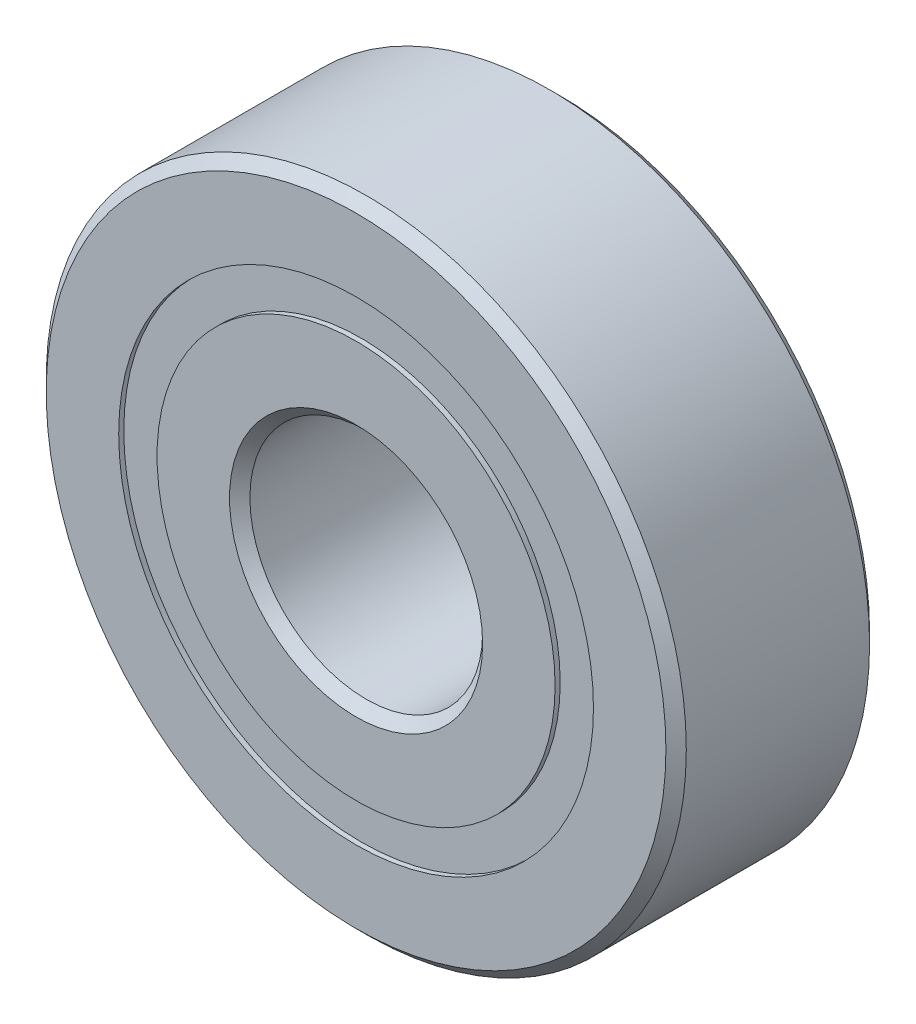
ISO-10303-21;
HEADER;
FILE_DESCRIPTION(('STEP AP214'),'2;1');
FILE_NAME('part.step','',(''),(''),'','','');
FILE_SCHEMA(('AUTOMOTIVE_DESIGN { 1 0 10303 214 1 1 1 1 }'));
ENDSEC;
DATA;
#1=APPLICATION_CONTEXT('core data for automotive mechanical design processes');
#2=APPLICATION_PROTOCOL_DEFINITION('international standard','automotive_design',2000,#1);
#3=PRODUCT_CONTEXT('',#1,'mechanical');
#4=PRODUCT('Part','Part','',(#3));
#5=PRODUCT_RELATED_PRODUCT_CATEGORY('part','',(#4));
#6=PRODUCT_DEFINITION_FORMATION('','',#4);
#7=PRODUCT_DEFINITION_CONTEXT('part definition',#1,'design');
#8=PRODUCT_DEFINITION('design','',#6,#7);
#9=PRODUCT_DEFINITION_SHAPE('','',#8);
#10=(LENGTH_UNIT() NAMED_UNIT(*) SI_UNIT(.MILLI.,.METRE.));
#11=(NAMED_UNIT(*) PLANE_ANGLE_UNIT() SI_UNIT($,.RADIAN.));
#12=(NAMED_UNIT(*) SI_UNIT($,.STERADIAN.) SOLID_ANGLE_UNIT());
#13=UNCERTAINTY_MEASURE_WITH_UNIT(LENGTH_MEASURE(1.E-05),#10,'distance_accuracy_value','');
#14=(GEOMETRIC_REPRESENTATION_CONTEXT(3) GLOBAL_UNCERTAINTY_ASSIGNED_CONTEXT((#13)) GLOBAL_UNIT_ASSIGNED_CONTEXT((#10,
#11,#12)) REPRESENTATION_CONTEXT('',''));
#15=CARTESIAN_POINT('',(0.,0.,0.));
#16=DIRECTION('',(0.,0.,1.));
#17=DIRECTION('',(1.,0.,0.));
#18=AXIS2_PLACEMENT_3D('',#15,#16,#17);
#19=CARTESIAN_POINT('',(0.,8.15934065934066,-3.325));
#20=DIRECTION('',(0.,0.,1.));
#21=DIRECTION('',(1.,0.,0.));
#22=AXIS2_PLACEMENT_3D('',#19,#20,#21);
#23=PLANE('',#22);
#24=CARTESIAN_POINT('',(0.,0.,-3.325));
#25=DIRECTION('',(0.,0.,1.));
#26=DIRECTION('',(1.,0.,0.));
#27=AXIS2_PLACEMENT_3D('',#24,#25,#26);
#28=CIRCLE('',#27,8.15934065934066);
#29=CARTESIAN_POINT('',(8.15934065934066,0.,-3.325));
#30=VERTEX_POINT('',#29);
#31=EDGE_CURVE('E59',#30,#30,#28,.T.);
#32=ORIENTED_EDGE('',*,*,#31,.F.);
#33=EDGE_LOOP('',(#32));
#34=FACE_BOUND('',#33,.T.);
#35=CARTESIAN_POINT('',(0.,0.,-3.325));
#36=DIRECTION('',(0.,0.,1.));
#37=DIRECTION('',(1.,0.,0.));
#38=AXIS2_PLACEMENT_3D('',#35,#36,#37);
#39=CIRCLE('',#38,6.84065934065934);
#40=CARTESIAN_POINT('',(6.84065934065934,0.,-3.325));
#41=VERTEX_POINT('',#40);
#42=EDGE_CURVE('E11',#41,#41,#39,.T.);
#43=ORIENTED_EDGE('',*,*,#42,.T.);
#44=EDGE_LOOP('',(#43));
#45=FACE_BOUND('',#44,.T.);
#46=ADVANCED_FACE('F45',(#34,#45),#23,.F.);
#47=CARTESIAN_POINT('',(0.,0.,3.5));
#48=DIRECTION('',(0.,0.,1.));
#49=DIRECTION('',(1.,0.,0.));
#50=AXIS2_PLACEMENT_3D('',#47,#48,#49);
#51=CYLINDRICAL_SURFACE('',#50,6.84065934065934);
#52=ORIENTED_EDGE('',*,*,#42,.F.);
#53=EDGE_LOOP('',(#52));
#54=FACE_BOUND('',#53,.T.);
#55=CARTESIAN_POINT('',(0.,0.,-1.68952158656808));
#56=DIRECTION('',(0.,0.,1.));
#57=DIRECTION('',(1.,0.,0.));
#58=AXIS2_PLACEMENT_3D('',#55,#56,#57);
#59=CIRCLE('',#58,6.84065934065934);
#60=CARTESIAN_POINT('',(6.84065934065934,0.,-1.68952158656808));
#61=VERTEX_POINT('',#60);
#62=EDGE_CURVE('E51',#61,#61,#59,.T.);
#63=ORIENTED_EDGE('',*,*,#62,.T.);
#64=EDGE_LOOP('',(#63));
#65=FACE_BOUND('',#64,.T.);
#66=ADVANCED_FACE('F68',(#54,#65),#51,.F.);
#67=CARTESIAN_POINT('',(0.,8.15934065934066,-1.68952158656808));
#68=DIRECTION('',(0.,0.,-1.));
#69=DIRECTION('',(-1.,0.,0.));
#70=AXIS2_PLACEMENT_3D('',#67,#68,#69);
#71=PLANE('',#70);
#72=ORIENTED_EDGE('',*,*,#62,.F.);
#73=EDGE_LOOP('',(#72));
#74=FACE_BOUND('',#73,.T.);
#75=CARTESIAN_POINT('',(0.,0.,-1.68952158656808));
#76=DIRECTION('',(0.,0.,1.));
#77=DIRECTION('',(1.,0.,0.));
#78=AXIS2_PLACEMENT_3D('',#75,#76,#77);
#79=CIRCLE('',#78,8.15934065934066);
#80=CARTESIAN_POINT('',(8.15934065934066,0.,-1.68952158656808));
#81=VERTEX_POINT('',#80);
#82=EDGE_CURVE('E55',#81,#81,#79,.T.);
#83=ORIENTED_EDGE('',*,*,#82,.T.);
#84=EDGE_LOOP('',(#83));
#85=FACE_BOUND('',#84,.T.);
#86=ADVANCED_FACE('F72',(#74,#85),#71,.F.);
#87=CARTESIAN_POINT('',(0.,0.,3.5));
#88=DIRECTION('',(0.,0.,1.));
#89=DIRECTION('',(1.,0.,0.));
#90=AXIS2_PLACEMENT_3D('',#87,#88,#89);
#91=CYLINDRICAL_SURFACE('',#90,8.15934065934066);
#92=ORIENTED_EDGE('',*,*,#82,.F.);
#93=EDGE_LOOP('',(#92));
#94=FACE_BOUND('',#93,.T.);
#95=ORIENTED_EDGE('',*,*,#31,.T.);
#96=EDGE_LOOP('',(#95));
#97=FACE_BOUND('',#96,.T.);
#98=ADVANCED_FACE('F65',(#94,#97),#91,.T.);
#99=CLOSED_SHELL('',(#46,#66,#86,#98));
#100=MANIFOLD_SOLID_BREP('B2',#99);
#101=CARTESIAN_POINT('',(0.,8.15934065934066,3.325));
#102=DIRECTION('',(0.,0.,-1.));
#103=DIRECTION('',(-1.,0.,0.));
#104=AXIS2_PLACEMENT_3D('',#101,#102,#103);
#105=PLANE('',#104);
#106=CARTESIAN_POINT('',(0.,0.,3.325));
#107=DIRECTION('',(0.,0.,1.));
#108=DIRECTION('',(1.,0.,0.));
#109=AXIS2_PLACEMENT_3D('',#106,#107,#108);
#110=CIRCLE('',#109,6.84065934065934);
#111=CARTESIAN_POINT('',(6.84065934065934,0.,3.325));
#112=VERTEX_POINT('',#111);
#113=EDGE_CURVE('E44',#112,#112,#110,.T.);
#114=ORIENTED_EDGE('',*,*,#113,.F.);
#115=EDGE_LOOP('',(#114));
#116=FACE_BOUND('',#115,.T.);
#117=CARTESIAN_POINT('',(0.,0.,3.325));
#118=DIRECTION('',(0.,0.,1.));
#119=DIRECTION('',(1.,0.,0.));
#120=AXIS2_PLACEMENT_3D('',#117,#118,#119);
#121=CIRCLE('',#120,8.15934065934066);
#122=CARTESIAN_POINT('',(8.15934065934066,0.,3.325));
#123=VERTEX_POINT('',#122);
#124=EDGE_CURVE('E126',#123,#123,#121,.T.);
#125=ORIENTED_EDGE('',*,*,#124,.T.);
#126=EDGE_LOOP('',(#125));
#127=FACE_BOUND('',#126,.T.);
#128=ADVANCED_FACE('F112',(#116,#127),#105,.F.);
#129=CARTESIAN_POINT('',(0.,0.,3.5));
#130=DIRECTION('',(0.,0.,1.));
#131=DIRECTION('',(1.,0.,0.));
#132=AXIS2_PLACEMENT_3D('',#129,#130,#131);
#133=CYLINDRICAL_SURFACE('',#132,6.84065934065934);
#134=CARTESIAN_POINT('',(0.,0.,1.68952158656808));
#135=DIRECTION('',(0.,0.,1.));
#136=DIRECTION('',(1.,0.,0.));
#137=AXIS2_PLACEMENT_3D('',#134,#135,#136);
#138=CIRCLE('',#137,6.84065934065934);
#139=CARTESIAN_POINT('',(6.84065934065934,0.,1.68952158656808));
#140=VERTEX_POINT('',#139);
#141=EDGE_CURVE('E118',#140,#140,#138,.T.);
#142=ORIENTED_EDGE('',*,*,#141,.F.);
#143=EDGE_LOOP('',(#142));
#144=FACE_BOUND('',#143,.T.);
#145=ORIENTED_EDGE('',*,*,#113,.T.);
#146=EDGE_LOOP('',(#145));
#147=FACE_BOUND('',#146,.T.);
#148=ADVANCED_FACE('F141',(#144,#147),#133,.F.);
#149=CARTESIAN_POINT('',(0.,8.15934065934066,1.68952158656808));
#150=DIRECTION('',(0.,0.,1.));
#151=DIRECTION('',(1.,0.,0.));
#152=AXIS2_PLACEMENT_3D('',#149,#150,#151);
#153=PLANE('',#152);
#154=CARTESIAN_POINT('',(0.,0.,1.68952158656808));
#155=DIRECTION('',(0.,0.,1.));
#156=DIRECTION('',(1.,0.,0.));
#157=AXIS2_PLACEMENT_3D('',#154,#155,#156);
#158=CIRCLE('',#157,8.15934065934066);
#159=CARTESIAN_POINT('',(8.15934065934066,0.,1.68952158656808));
#160=VERTEX_POINT('',#159);
#161=EDGE_CURVE('E122',#160,#160,#158,.T.);
#162=ORIENTED_EDGE('',*,*,#161,.F.);
#163=EDGE_LOOP('',(#162));
#164=FACE_BOUND('',#163,.T.);
#165=ORIENTED_EDGE('',*,*,#141,.T.);
#166=EDGE_LOOP('',(#165));
#167=FACE_BOUND('',#166,.T.);
#168=ADVANCED_FACE('F136',(#164,#167),#153,.F.);
#169=CARTESIAN_POINT('',(0.,0.,3.5));
#170=DIRECTION('',(0.,0.,1.));
#171=DIRECTION('',(1.,0.,0.));
#172=AXIS2_PLACEMENT_3D('',#169,#170,#171);
#173=CYLINDRICAL_SURFACE('',#172,8.15934065934066);
#174=ORIENTED_EDGE('',*,*,#124,.F.);
#175=EDGE_LOOP('',(#174));
#176=FACE_BOUND('',#175,.T.);
#177=ORIENTED_EDGE('',*,*,#161,.T.);
#178=EDGE_LOOP('',(#177));
#179=FACE_BOUND('',#178,.T.);
#180=ADVANCED_FACE('F133',(#176,#179),#173,.T.);
#181=CLOSED_SHELL('',(#128,#148,#168,#180));
#182=MANIFOLD_SOLID_BREP('B6',#181);
#183=CARTESIAN_POINT('',(-3.74999999999992,6.49519052838334,0.));
#184=DIRECTION('',(0.,0.,1.));
#185=DIRECTION('',(-0.499999999999989,0.866025403784445,0.));
#186=AXIS2_PLACEMENT_3D('',#183,#184,#185);
#187=SPHERICAL_SURFACE('',#186,1.68952158656808);
#188=CARTESIAN_POINT('',(-3.74999999999992,6.49519052838334,1.68952158656808));
#189=VERTEX_POINT('',#188);
#190=VERTEX_LOOP('',#189);
#191=FACE_BOUND('',#190,.T.);
#192=ADVANCED_FACE('F179',(#191),#187,.T.);
#193=CLOSED_SHELL('',(#192));
#194=MANIFOLD_SOLID_BREP('B39',#193);
#195=CARTESIAN_POINT('',(-6.49519052838325,3.75000000000008,0.));
#196=DIRECTION('',(0.,0.,1.));
#197=DIRECTION('',(-0.866025403784433,0.50000000000001,0.));
#198=AXIS2_PLACEMENT_3D('',#195,#196,#197);
#199=SPHERICAL_SURFACE('',#198,1.68952158656808);
#200=CARTESIAN_POINT('',(-6.49519052838325,3.75000000000008,1.68952158656808));
#201=VERTEX_POINT('',#200);
#202=VERTEX_LOOP('',#201);
#203=FACE_BOUND('',#202,.T.);
#204=ADVANCED_FACE('F199',(#203),#199,.T.);
#205=CLOSED_SHELL('',(#204));
#206=MANIFOLD_SOLID_BREP('B108',#205);
#207=CARTESIAN_POINT('',(-7.5,0.,0.));
#208=DIRECTION('',(0.,0.,1.));
#209=DIRECTION('',(-1.,0.,0.));
#210=AXIS2_PLACEMENT_3D('',#207,#208,#209);
#211=SPHERICAL_SURFACE('',#210,1.68952158656808);
#212=CARTESIAN_POINT('',(-7.5,0.,1.68952158656808));
#213=VERTEX_POINT('',#212);
#214=VERTEX_LOOP('',#213);
#215=FACE_BOUND('',#214,.T.);
#216=ADVANCED_FACE('F219',(#215),#211,.T.);
#217=CLOSED_SHELL('',(#216));
#218=MANIFOLD_SOLID_BREP('B175',#217);
#219=CARTESIAN_POINT('',(-6.49519052838332,-3.74999999999994,0.));
#220=DIRECTION('',(0.,0.,1.));
#221=DIRECTION('',(-0.866025403784443,-0.499999999999992,0.));
#222=AXIS2_PLACEMENT_3D('',#219,#220,#221);
#223=SPHERICAL_SURFACE('',#222,1.68952158656808);
#224=CARTESIAN_POINT('',(-6.49519052838332,-3.74999999999994,1.68952158656808));
#225=VERTEX_POINT('',#224);
#226=VERTEX_LOOP('',#225);
#227=FACE_BOUND('',#226,.T.);
#228=ADVANCED_FACE('F239',(#227),#223,.T.);
#229=CLOSED_SHELL('',(#228));
#230=MANIFOLD_SOLID_BREP('B195',#229);
#231=CARTESIAN_POINT('',(-3.75000000000005,-6.49519052838326,0.));
#232=DIRECTION('',(0.,0.,1.));
#233=DIRECTION('',(-0.500000000000007,-0.866025403784435,0.));
#234=AXIS2_PLACEMENT_3D('',#231,#232,#233);
#235=SPHERICAL_SURFACE('',#234,1.68952158656808);
#236=CARTESIAN_POINT('',(-3.75000000000005,-6.49519052838326,1.68952158656808));
#237=VERTEX_POINT('',#236);
#238=VERTEX_LOOP('',#237);
#239=FACE_BOUND('',#238,.T.);
#240=ADVANCED_FACE('F259',(#239),#235,.T.);
#241=CLOSED_SHELL('',(#240));
#242=MANIFOLD_SOLID_BREP('B215',#241);
#243=CARTESIAN_POINT('',(0.,-7.5,0.));
#244=DIRECTION('',(0.,0.,1.));
#245=DIRECTION('',(0.,-1.,0.));
#246=AXIS2_PLACEMENT_3D('',#243,#244,#245);
#247=SPHERICAL_SURFACE('',#246,1.68952158656808);
#248=CARTESIAN_POINT('',(0.,-7.5,1.68952158656808));
#249=VERTEX_POINT('',#248);
#250=VERTEX_LOOP('',#249);
#251=FACE_BOUND('',#250,.T.);
#252=ADVANCED_FACE('F279',(#251),#247,.T.);
#253=CLOSED_SHELL('',(#252));
#254=MANIFOLD_SOLID_BREP('B235',#253);
#255=CARTESIAN_POINT('',(3.74999999999996,-6.49519052838331,0.));
#256=DIRECTION('',(0.,0.,1.));
#257=DIRECTION('',(0.499999999999995,-0.866025403784442,0.));
#258=AXIS2_PLACEMENT_3D('',#255,#256,#257);
#259=SPHERICAL_SURFACE('',#258,1.68952158656808);
#260=CARTESIAN_POINT('',(3.74999999999996,-6.49519052838331,1.68952158656808));
#261=VERTEX_POINT('',#260);
#262=VERTEX_LOOP('',#261);
#263=FACE_BOUND('',#262,.T.);
#264=ADVANCED_FACE('F299',(#263),#259,.T.);
#265=CLOSED_SHELL('',(#264));
#266=MANIFOLD_SOLID_BREP('B255',#265);
#267=CARTESIAN_POINT('',(6.49519052838327,-3.75000000000003,0.));
#268=DIRECTION('',(0.,0.,1.));
#269=DIRECTION('',(0.866025403784436,-0.500000000000004,0.));
#270=AXIS2_PLACEMENT_3D('',#267,#268,#269);
#271=SPHERICAL_SURFACE('',#270,1.68952158656808);
#272=CARTESIAN_POINT('',(6.49519052838327,-3.75000000000003,1.68952158656808));
#273=VERTEX_POINT('',#272);
#274=VERTEX_LOOP('',#273);
#275=FACE_BOUND('',#274,.T.);
#276=ADVANCED_FACE('F319',(#275),#271,.T.);
#277=CLOSED_SHELL('',(#276));
#278=MANIFOLD_SOLID_BREP('B275',#277);
#279=CARTESIAN_POINT('',(7.5,0.,0.));
#280=DIRECTION('',(0.,0.,1.));
#281=DIRECTION('',(1.,0.,0.));
#282=AXIS2_PLACEMENT_3D('',#279,#280,#281);
#283=SPHERICAL_SURFACE('',#282,1.68952158656808);
#284=CARTESIAN_POINT('',(7.5,0.,1.68952158656808));
#285=VERTEX_POINT('',#284);
#286=VERTEX_LOOP('',#285);
#287=FACE_BOUND('',#286,.T.);
#288=ADVANCED_FACE('F339',(#287),#283,.T.);
#289=CLOSED_SHELL('',(#288));
#290=MANIFOLD_SOLID_BREP('B295',#289);
#291=CARTESIAN_POINT('',(6.4951905283833,3.74999999999998,0.));
#292=DIRECTION('',(0.,0.,1.));
#293=DIRECTION('',(0.86602540378444,0.499999999999998,0.));
#294=AXIS2_PLACEMENT_3D('',#291,#292,#293);
#295=SPHERICAL_SURFACE('',#294,1.68952158656808);
#296=CARTESIAN_POINT('',(6.4951905283833,3.74999999999998,1.68952158656808));
#297=VERTEX_POINT('',#296);
#298=VERTEX_LOOP('',#297);
#299=FACE_BOUND('',#298,.T.);
#300=ADVANCED_FACE('F359',(#299),#295,.T.);
#301=CLOSED_SHELL('',(#300));
#302=MANIFOLD_SOLID_BREP('B315',#301);
#303=CARTESIAN_POINT('',(3.75000000000001,6.49519052838328,0.));
#304=DIRECTION('',(0.,0.,1.));
#305=DIRECTION('',(0.500000000000001,0.866025403784438,0.));
#306=AXIS2_PLACEMENT_3D('',#303,#304,#305);
#307=SPHERICAL_SURFACE('',#306,1.68952158656808);
#308=CARTESIAN_POINT('',(3.75000000000001,6.49519052838328,1.68952158656808));
#309=VERTEX_POINT('',#308);
#310=VERTEX_LOOP('',#309);
#311=FACE_BOUND('',#310,.T.);
#312=ADVANCED_FACE('F379',(#311),#307,.T.);
#313=CLOSED_SHELL('',(#312));
#314=MANIFOLD_SOLID_BREP('B335',#313);
#315=CARTESIAN_POINT('',(0.,7.5,0.));
#316=DIRECTION('',(0.,0.,1.));
#317=DIRECTION('',(0.,1.,0.));
#318=AXIS2_PLACEMENT_3D('',#315,#316,#317);
#319=SPHERICAL_SURFACE('',#318,1.68952158656808);
#320=CARTESIAN_POINT('',(0.,7.5,1.68952158656808));
#321=VERTEX_POINT('',#320);
#322=VERTEX_LOOP('',#321);
#323=FACE_BOUND('',#322,.T.);
#324=ADVANCED_FACE('F401',(#323),#319,.T.);
#325=CLOSED_SHELL('',(#324));
#326=MANIFOLD_SOLID_BREP('B355',#325);
#327=CARTESIAN_POINT('',(0.,6.84065934065934,3.5));
#328=DIRECTION('',(0.,0.,-1.));
#329=DIRECTION('',(-1.,0.,0.));
#330=AXIS2_PLACEMENT_3D('',#327,#328,#329);
#331=PLANE('',#330);
#332=CARTESIAN_POINT('',(0.,0.,3.5));
#333=DIRECTION('',(0.,0.,1.));
#334=DIRECTION('',(1.,0.,0.));
#335=AXIS2_PLACEMENT_3D('',#332,#333,#334);
#336=CIRCLE('',#335,4.35);
#337=CARTESIAN_POINT('',(4.35,0.,3.5));
#338=VERTEX_POINT('',#337);
#339=EDGE_CURVE('E448',#338,#338,#336,.T.);
#340=ORIENTED_EDGE('',*,*,#339,.F.);
#341=EDGE_LOOP('',(#340));
#342=FACE_BOUND('',#341,.T.);
#343=CARTESIAN_POINT('',(0.,0.,3.5));
#344=DIRECTION('',(0.,0.,1.));
#345=DIRECTION('',(1.,0.,0.));
#346=AXIS2_PLACEMENT_3D('',#343,#344,#345);
#347=CIRCLE('',#346,6.84065934065934);
#348=CARTESIAN_POINT('',(6.84065934065934,0.,3.5));
#349=VERTEX_POINT('',#348);
#350=EDGE_CURVE('E400',#349,#349,#347,.T.);
#351=ORIENTED_EDGE('',*,*,#350,.T.);
#352=EDGE_LOOP('',(#351));
#353=FACE_BOUND('',#352,.T.);
#354=ADVANCED_FACE('F420',(#342,#353),#331,.F.);
#355=CARTESIAN_POINT('',(0.,0.,3.5));
#356=DIRECTION('',(0.,0.,1.));
#357=DIRECTION('',(1.,0.,0.));
#358=AXIS2_PLACEMENT_3D('',#355,#356,#357);
#359=CYLINDRICAL_SURFACE('',#358,6.84065934065934);
#360=ORIENTED_EDGE('',*,*,#350,.F.);
#361=EDGE_LOOP('',(#360));
#362=FACE_BOUND('',#361,.T.);
#363=CARTESIAN_POINT('',(0.,0.,1.55555555555556));
#364=DIRECTION('',(0.,0.,1.));
#365=DIRECTION('',(1.,0.,0.));
#366=AXIS2_PLACEMENT_3D('',#363,#364,#365);
#367=CIRCLE('',#366,6.84065934065934);
#368=CARTESIAN_POINT('',(6.84065934065934,0.,1.55555555555556));
#369=VERTEX_POINT('',#368);
#370=EDGE_CURVE('E426',#369,#369,#367,.T.);
#371=ORIENTED_EDGE('',*,*,#370,.T.);
#372=EDGE_LOOP('',(#371));
#373=FACE_BOUND('',#372,.T.);
#374=ADVANCED_FACE('F455',(#362,#373),#359,.T.);
#375=CARTESIAN_POINT('',(0.,0.,0.));
#376=DIRECTION('',(0.,0.,1.));
#377=DIRECTION('',(1.,0.,0.));
#378=AXIS2_PLACEMENT_3D('',#375,#376,#377);
#379=TOROIDAL_SURFACE('',#378,7.49999999999999,1.68952158656808);
#380=ORIENTED_EDGE('',*,*,#370,.F.);
#381=EDGE_LOOP('',(#380));
#382=FACE_BOUND('',#381,.T.);
#383=CARTESIAN_POINT('',(0.,0.,-1.55555555555556));
#384=DIRECTION('',(0.,0.,1.));
#385=DIRECTION('',(1.,0.,0.));
#386=AXIS2_PLACEMENT_3D('',#383,#384,#385);
#387=CIRCLE('',#386,6.84065934065934);
#388=CARTESIAN_POINT('',(6.84065934065934,0.,-1.55555555555556));
#389=VERTEX_POINT('',#388);
#390=EDGE_CURVE('E430',#389,#389,#387,.T.);
#391=ORIENTED_EDGE('',*,*,#390,.T.);
#392=EDGE_LOOP('',(#391));
#393=FACE_BOUND('',#392,.T.);
#394=ADVANCED_FACE('F459',(#382,#393),#379,.F.);
#395=CARTESIAN_POINT('',(0.,0.,3.5));
#396=DIRECTION('',(0.,0.,1.));
#397=DIRECTION('',(1.,0.,0.));
#398=AXIS2_PLACEMENT_3D('',#395,#396,#397);
#399=CYLINDRICAL_SURFACE('',#398,6.84065934065934);
#400=ORIENTED_EDGE('',*,*,#390,.F.);
#401=EDGE_LOOP('',(#400));
#402=FACE_BOUND('',#401,.T.);
#403=CARTESIAN_POINT('',(0.,0.,-3.5));
#404=DIRECTION('',(0.,0.,1.));
#405=DIRECTION('',(1.,0.,0.));
#406=AXIS2_PLACEMENT_3D('',#403,#404,#405);
#407=CIRCLE('',#406,6.84065934065934);
#408=CARTESIAN_POINT('',(6.84065934065934,0.,-3.5));
#409=VERTEX_POINT('',#408);
#410=EDGE_CURVE('E434',#409,#409,#407,.T.);
#411=ORIENTED_EDGE('',*,*,#410,.T.);
#412=EDGE_LOOP('',(#411));
#413=FACE_BOUND('',#412,.T.);
#414=ADVANCED_FACE('F464',(#402,#413),#399,.T.);
#415=CARTESIAN_POINT('',(0.,4.35,-3.5));
#416=DIRECTION('',(0.,0.,1.));
#417=DIRECTION('',(1.,0.,0.));
#418=AXIS2_PLACEMENT_3D('',#415,#416,#417);
#419=PLANE('',#418);
#420=ORIENTED_EDGE('',*,*,#410,.F.);
#421=EDGE_LOOP('',(#420));
#422=FACE_BOUND('',#421,.T.);
#423=CARTESIAN_POINT('',(0.,0.,-3.5));
#424=DIRECTION('',(0.,0.,1.));
#425=DIRECTION('',(1.,0.,0.));
#426=AXIS2_PLACEMENT_3D('',#423,#424,#425);
#427=CIRCLE('',#426,4.35);
#428=CARTESIAN_POINT('',(4.35,0.,-3.5));
#429=VERTEX_POINT('',#428);
#430=EDGE_CURVE('E439',#429,#429,#427,.T.);
#431=ORIENTED_EDGE('',*,*,#430,.T.);
#432=EDGE_LOOP('',(#431));
#433=FACE_BOUND('',#432,.T.);
#434=ADVANCED_FACE('F470',(#422,#433),#419,.F.);
#435=CARTESIAN_POINT('',(0.,0.,-3.15));
#436=DIRECTION('',(0.,0.,-1.));
#437=DIRECTION('',(-1.,0.,0.));
#438=AXIS2_PLACEMENT_3D('',#435,#436,#437);
#439=CONICAL_SURFACE('',#438,4.,0.785398163397451);
#440=ORIENTED_EDGE('',*,*,#430,.F.);
#441=EDGE_LOOP('',(#440));
#442=FACE_BOUND('',#441,.T.);
#443=CARTESIAN_POINT('',(0.,0.,-3.15));
#444=DIRECTION('',(0.,0.,1.));
#445=DIRECTION('',(1.,0.,0.));
#446=AXIS2_PLACEMENT_3D('',#443,#444,#445);
#447=CIRCLE('',#446,4.);
#448=CARTESIAN_POINT('',(4.,0.,-3.15));
#449=VERTEX_POINT('',#448);
#450=EDGE_CURVE('E442',#449,#449,#447,.T.);
#451=ORIENTED_EDGE('',*,*,#450,.T.);
#452=EDGE_LOOP('',(#451));
#453=FACE_BOUND('',#452,.T.);
#454=ADVANCED_FACE('F474',(#442,#453),#439,.F.);
#455=CARTESIAN_POINT('',(0.,0.,3.5));
#456=DIRECTION('',(0.,0.,1.));
#457=DIRECTION('',(1.,0.,0.));
#458=AXIS2_PLACEMENT_3D('',#455,#456,#457);
#459=CYLINDRICAL_SURFACE('',#458,4.);
#460=ORIENTED_EDGE('',*,*,#450,.F.);
#461=EDGE_LOOP('',(#460));
#462=FACE_BOUND('',#461,.T.);
#463=CARTESIAN_POINT('',(0.,0.,3.15));
#464=DIRECTION('',(0.,0.,1.));
#465=DIRECTION('',(1.,0.,0.));
#466=AXIS2_PLACEMENT_3D('',#463,#464,#465);
#467=CIRCLE('',#466,4.);
#468=CARTESIAN_POINT('',(4.,0.,3.15));
#469=VERTEX_POINT('',#468);
#470=EDGE_CURVE('E445',#469,#469,#467,.T.);
#471=ORIENTED_EDGE('',*,*,#470,.T.);
#472=EDGE_LOOP('',(#471));
#473=FACE_BOUND('',#472,.T.);
#474=ADVANCED_FACE('F478',(#462,#473),#459,.F.);
#475=CARTESIAN_POINT('',(0.,0.,3.5));
#476=DIRECTION('',(0.,0.,1.));
#477=DIRECTION('',(1.,0.,0.));
#478=AXIS2_PLACEMENT_3D('',#475,#476,#477);
#479=CONICAL_SURFACE('',#478,4.35,0.785398163397447);
#480=ORIENTED_EDGE('',*,*,#470,.F.);
#481=EDGE_LOOP('',(#480));
#482=FACE_BOUND('',#481,.T.);
#483=ORIENTED_EDGE('',*,*,#339,.T.);
#484=EDGE_LOOP('',(#483));
#485=FACE_BOUND('',#484,.T.);
#486=ADVANCED_FACE('F452',(#482,#485),#479,.F.);
#487=CLOSED_SHELL('',(#354,#374,#394,#414,#434,#454,#474,#486));
#488=MANIFOLD_SOLID_BREP('B375',#487);
#489=CARTESIAN_POINT('',(0.,0.,3.15));
#490=DIRECTION('',(0.,0.,-1.));
#491=DIRECTION('',(-1.,0.,0.));
#492=AXIS2_PLACEMENT_3D('',#489,#490,#491);
#493=CONICAL_SURFACE('',#492,11.,0.78539816339745);
#494=CARTESIAN_POINT('',(0.,0.,3.5));
#495=DIRECTION('',(0.,0.,1.));
#496=DIRECTION('',(1.,0.,0.));
#497=AXIS2_PLACEMENT_3D('',#494,#495,#496);
#498=CIRCLE('',#497,10.65);
#499=CARTESIAN_POINT('',(10.65,0.,3.5));
#500=VERTEX_POINT('',#499);
#501=EDGE_CURVE('E569',#500,#500,#498,.T.);
#502=ORIENTED_EDGE('',*,*,#501,.F.);
#503=EDGE_LOOP('',(#502));
#504=FACE_BOUND('',#503,.T.);
#505=CARTESIAN_POINT('',(0.,0.,3.15));
#506=DIRECTION('',(0.,0.,1.));
#507=DIRECTION('',(1.,0.,0.));
#508=AXIS2_PLACEMENT_3D('',#505,#506,#507);
#509=CIRCLE('',#508,11.);
#510=CARTESIAN_POINT('',(11.,0.,3.15));
#511=VERTEX_POINT('',#510);
#512=EDGE_CURVE('E419',#511,#511,#509,.T.);
#513=ORIENTED_EDGE('',*,*,#512,.T.);
#514=EDGE_LOOP('',(#513));
#515=FACE_BOUND('',#514,.T.);
#516=ADVANCED_FACE('F541',(#504,#515),#493,.T.);
#517=CARTESIAN_POINT('',(0.,0.,3.5));
#518=DIRECTION('',(0.,0.,1.));
#519=DIRECTION('',(1.,0.,0.));
#520=AXIS2_PLACEMENT_3D('',#517,#518,#519);
#521=CYLINDRICAL_SURFACE('',#520,11.);
#522=ORIENTED_EDGE('',*,*,#512,.F.);
#523=EDGE_LOOP('',(#522));
#524=FACE_BOUND('',#523,.T.);
#525=CARTESIAN_POINT('',(0.,0.,-3.15));
#526=DIRECTION('',(0.,0.,1.));
#527=DIRECTION('',(1.,0.,0.));
#528=AXIS2_PLACEMENT_3D('',#525,#526,#527);
#529=CIRCLE('',#528,11.);
#530=CARTESIAN_POINT('',(11.,0.,-3.15));
#531=VERTEX_POINT('',#530);
#532=EDGE_CURVE('E547',#531,#531,#529,.T.);
#533=ORIENTED_EDGE('',*,*,#532,.T.);
#534=EDGE_LOOP('',(#533));
#535=FACE_BOUND('',#534,.T.);
#536=ADVANCED_FACE('F576',(#524,#535),#521,.T.);
#537=CARTESIAN_POINT('',(0.,0.,-3.5));
#538=DIRECTION('',(0.,0.,1.));
#539=DIRECTION('',(1.,0.,0.));
#540=AXIS2_PLACEMENT_3D('',#537,#538,#539);
#541=CONICAL_SURFACE('',#540,10.65,0.785398163397448);
#542=ORIENTED_EDGE('',*,*,#532,.F.);
#543=EDGE_LOOP('',(#542));
#544=FACE_BOUND('',#543,.T.);
#545=CARTESIAN_POINT('',(0.,0.,-3.5));
#546=DIRECTION('',(0.,0.,1.));
#547=DIRECTION('',(1.,0.,0.));
#548=AXIS2_PLACEMENT_3D('',#545,#546,#547);
#549=CIRCLE('',#548,10.65);
#550=CARTESIAN_POINT('',(10.65,0.,-3.5));
#551=VERTEX_POINT('',#550);
#552=EDGE_CURVE('E551',#551,#551,#549,.T.);
#553=ORIENTED_EDGE('',*,*,#552,.T.);
#554=EDGE_LOOP('',(#553));
#555=FACE_BOUND('',#554,.T.);
#556=ADVANCED_FACE('F580',(#544,#555),#541,.T.);
#557=CARTESIAN_POINT('',(0.,10.65,-3.5));
#558=DIRECTION('',(0.,0.,1.));
#559=DIRECTION('',(1.,0.,0.));
#560=AXIS2_PLACEMENT_3D('',#557,#558,#559);
#561=PLANE('',#560);
#562=ORIENTED_EDGE('',*,*,#552,.F.);
#563=EDGE_LOOP('',(#562));
#564=FACE_BOUND('',#563,.T.);
#565=CARTESIAN_POINT('',(0.,0.,-3.5));
#566=DIRECTION('',(0.,0.,1.));
#567=DIRECTION('',(1.,0.,0.));
#568=AXIS2_PLACEMENT_3D('',#565,#566,#567);
#569=CIRCLE('',#568,8.15934065934066);
#570=CARTESIAN_POINT('',(8.15934065934066,0.,-3.5));
#571=VERTEX_POINT('',#570);
#572=EDGE_CURVE('E555',#571,#571,#569,.T.);
#573=ORIENTED_EDGE('',*,*,#572,.T.);
#574=EDGE_LOOP('',(#573));
#575=FACE_BOUND('',#574,.T.);
#576=ADVANCED_FACE('F585',(#564,#575),#561,.F.);
#577=CARTESIAN_POINT('',(0.,0.,3.5));
#578=DIRECTION('',(0.,0.,1.));
#579=DIRECTION('',(1.,0.,0.));
#580=AXIS2_PLACEMENT_3D('',#577,#578,#579);
#581=CYLINDRICAL_SURFACE('',#580,8.15934065934066);
#582=ORIENTED_EDGE('',*,*,#572,.F.);
#583=EDGE_LOOP('',(#582));
#584=FACE_BOUND('',#583,.T.);
#585=CARTESIAN_POINT('',(0.,0.,-1.55555555555556));
#586=DIRECTION('',(0.,0.,1.));
#587=DIRECTION('',(1.,0.,0.));
#588=AXIS2_PLACEMENT_3D('',#585,#586,#587);
#589=CIRCLE('',#588,8.15934065934066);
#590=CARTESIAN_POINT('',(8.15934065934066,0.,-1.55555555555556));
#591=VERTEX_POINT('',#590);
#592=EDGE_CURVE('E560',#591,#591,#589,.T.);
#593=ORIENTED_EDGE('',*,*,#592,.T.);
#594=EDGE_LOOP('',(#593));
#595=FACE_BOUND('',#594,.T.);
#596=ADVANCED_FACE('F591',(#584,#595),#581,.F.);
#597=CARTESIAN_POINT('',(0.,0.,0.));
#598=DIRECTION('',(0.,0.,1.));
#599=DIRECTION('',(1.,0.,0.));
#600=AXIS2_PLACEMENT_3D('',#597,#598,#599);
#601=TOROIDAL_SURFACE('',#600,7.5,1.68952158656808);
#602=ORIENTED_EDGE('',*,*,#592,.F.);
#603=EDGE_LOOP('',(#602));
#604=FACE_BOUND('',#603,.T.);
#605=CARTESIAN_POINT('',(0.,0.,1.55555555555556));
#606=DIRECTION('',(0.,0.,1.));
#607=DIRECTION('',(1.,0.,0.));
#608=AXIS2_PLACEMENT_3D('',#605,#606,#607);
#609=CIRCLE('',#608,8.15934065934066);
#610=CARTESIAN_POINT('',(8.15934065934066,0.,1.55555555555556));
#611=VERTEX_POINT('',#610);
#612=EDGE_CURVE('E563',#611,#611,#609,.T.);
#613=ORIENTED_EDGE('',*,*,#612,.T.);
#614=EDGE_LOOP('',(#613));
#615=FACE_BOUND('',#614,.T.);
#616=ADVANCED_FACE('F595',(#604,#615),#601,.F.);
#617=CARTESIAN_POINT('',(0.,0.,3.5));
#618=DIRECTION('',(0.,0.,1.));
#619=DIRECTION('',(1.,0.,0.));
#620=AXIS2_PLACEMENT_3D('',#617,#618,#619);
#621=CYLINDRICAL_SURFACE('',#620,8.15934065934066);
#622=ORIENTED_EDGE('',*,*,#612,.F.);
#623=EDGE_LOOP('',(#622));
#624=FACE_BOUND('',#623,.T.);
#625=CARTESIAN_POINT('',(0.,0.,3.5));
#626=DIRECTION('',(0.,0.,1.));
#627=DIRECTION('',(1.,0.,0.));
#628=AXIS2_PLACEMENT_3D('',#625,#626,#627);
#629=CIRCLE('',#628,8.15934065934066);
#630=CARTESIAN_POINT('',(8.15934065934066,0.,3.5));
#631=VERTEX_POINT('',#630);
#632=EDGE_CURVE('E566',#631,#631,#629,.T.);
#633=ORIENTED_EDGE('',*,*,#632,.T.);
#634=EDGE_LOOP('',(#633));
#635=FACE_BOUND('',#634,.T.);
#636=ADVANCED_FACE('F599',(#624,#635),#621,.F.);
#637=CARTESIAN_POINT('',(0.,10.65,3.5));
#638=DIRECTION('',(0.,0.,-1.));
#639=DIRECTION('',(-1.,0.,0.));
#640=AXIS2_PLACEMENT_3D('',#637,#638,#639);
#641=PLANE('',#640);
#642=ORIENTED_EDGE('',*,*,#632,.F.);
#643=EDGE_LOOP('',(#642));
#644=FACE_BOUND('',#643,.T.);
#645=ORIENTED_EDGE('',*,*,#501,.T.);
#646=EDGE_LOOP('',(#645));
#647=FACE_BOUND('',#646,.T.);
#648=ADVANCED_FACE('F573',(#644,#647),#641,.F.);
#649=CLOSED_SHELL('',(#516,#536,#556,#576,#596,#616,#636,#648));
#650=MANIFOLD_SOLID_BREP('B395',#649);
#651=ADVANCED_BREP_SHAPE_REPRESENTATION('',(#18,#100,#182,#194,#206,#218,#230,#242,#254,#266,
#278,#290,#302,#314,#326,#488,#650),#14);
#652=SHAPE_DEFINITION_REPRESENTATION(#9,#651);
ENDSEC;
END-ISO-10303-21;
